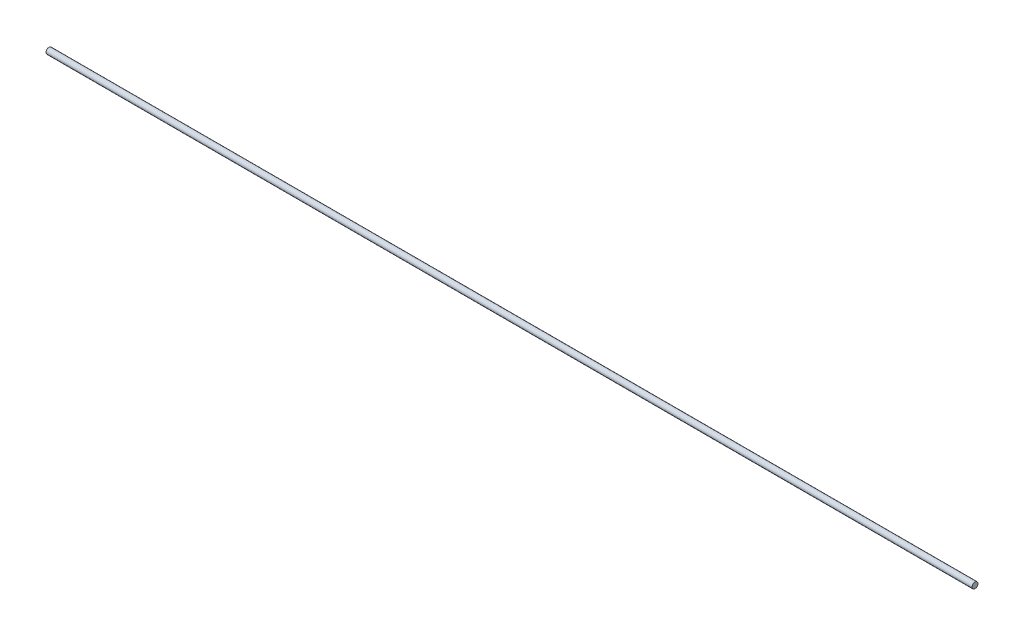
ISO-10303-21;
HEADER;
FILE_DESCRIPTION(('STEP AP214'),'2;1');
FILE_NAME('part.step','',(''),(''),'','','');
FILE_SCHEMA(('AUTOMOTIVE_DESIGN { 1 0 10303 214 1 1 1 1 }'));
ENDSEC;
DATA;
#1=APPLICATION_CONTEXT('core data for automotive mechanical design processes');
#2=APPLICATION_PROTOCOL_DEFINITION('international standard','automotive_design',2000,#1);
#3=PRODUCT_CONTEXT('',#1,'mechanical');
#4=PRODUCT('Part','Part','',(#3));
#5=PRODUCT_RELATED_PRODUCT_CATEGORY('part','',(#4));
#6=PRODUCT_DEFINITION_FORMATION('','',#4);
#7=PRODUCT_DEFINITION_CONTEXT('part definition',#1,'design');
#8=PRODUCT_DEFINITION('design','',#6,#7);
#9=PRODUCT_DEFINITION_SHAPE('','',#8);
#10=(LENGTH_UNIT() NAMED_UNIT(*) SI_UNIT(.MILLI.,.METRE.));
#11=(NAMED_UNIT(*) PLANE_ANGLE_UNIT() SI_UNIT($,.RADIAN.));
#12=(NAMED_UNIT(*) SI_UNIT($,.STERADIAN.) SOLID_ANGLE_UNIT());
#13=UNCERTAINTY_MEASURE_WITH_UNIT(LENGTH_MEASURE(1.E-05),#10,'distance_accuracy_value','');
#14=(GEOMETRIC_REPRESENTATION_CONTEXT(3) GLOBAL_UNCERTAINTY_ASSIGNED_CONTEXT((#13)) GLOBAL_UNIT_ASSIGNED_CONTEXT((#10,
#11,#12)) REPRESENTATION_CONTEXT('',''));
#15=CARTESIAN_POINT('',(0.,0.,0.));
#16=DIRECTION('',(0.,0.,1.));
#17=DIRECTION('',(1.,0.,0.));
#18=AXIS2_PLACEMENT_3D('',#15,#16,#17);
#19=CARTESIAN_POINT('',(495.3,0.,0.));
#20=DIRECTION('',(1.,0.,0.));
#21=DIRECTION('',(0.,0.,-1.));
#22=AXIS2_PLACEMENT_3D('',#19,#20,#21);
#23=PLANE('',#22);
#24=CARTESIAN_POINT('',(495.3,0.,0.));
#25=DIRECTION('',(1.,0.,0.));
#26=DIRECTION('',(0.,0.,-1.));
#27=AXIS2_PLACEMENT_3D('',#24,#25,#26);
#28=CIRCLE('',#27,3.175);
#29=CARTESIAN_POINT('',(495.3,0.,-3.175));
#30=VERTEX_POINT('',#29);
#31=EDGE_CURVE('E17',#30,#30,#28,.F.);
#32=ORIENTED_EDGE('',*,*,#31,.F.);
#33=EDGE_LOOP('',(#32));
#34=FACE_BOUND('',#33,.T.);
#35=ADVANCED_FACE('F14',(#34),#23,.T.);
#36=CARTESIAN_POINT('',(-495.3,0.,0.));
#37=DIRECTION('',(1.,0.,0.));
#38=DIRECTION('',(0.,0.,-1.));
#39=AXIS2_PLACEMENT_3D('',#36,#37,#38);
#40=PLANE('',#39);
#41=CARTESIAN_POINT('',(-495.3,0.,0.));
#42=DIRECTION('',(1.,0.,0.));
#43=DIRECTION('',(0.,0.,-1.));
#44=AXIS2_PLACEMENT_3D('',#41,#42,#43);
#45=CIRCLE('',#44,3.175);
#46=CARTESIAN_POINT('',(-495.3,0.,-3.175));
#47=VERTEX_POINT('',#46);
#48=EDGE_CURVE('E10',#47,#47,#45,.T.);
#49=ORIENTED_EDGE('',*,*,#48,.F.);
#50=EDGE_LOOP('',(#49));
#51=FACE_BOUND('',#50,.T.);
#52=ADVANCED_FACE('F29',(#51),#40,.F.);
#53=CARTESIAN_POINT('',(-495.3,0.,0.));
#54=DIRECTION('',(1.,0.,0.));
#55=DIRECTION('',(0.,0.,-1.));
#56=AXIS2_PLACEMENT_3D('',#53,#54,#55);
#57=CYLINDRICAL_SURFACE('',#56,3.175);
#58=ORIENTED_EDGE('',*,*,#31,.T.);
#59=EDGE_LOOP('',(#58));
#60=FACE_BOUND('',#59,.T.);
#61=ORIENTED_EDGE('',*,*,#48,.T.);
#62=EDGE_LOOP('',(#61));
#63=FACE_BOUND('',#62,.T.);
#64=ADVANCED_FACE('F26',(#60,#63),#57,.T.);
#65=CLOSED_SHELL('',(#35,#52,#64));
#66=MANIFOLD_SOLID_BREP('B1',#65);
#67=ADVANCED_BREP_SHAPE_REPRESENTATION('',(#18,#66),#14);
#68=SHAPE_DEFINITION_REPRESENTATION(#9,#67);
ENDSEC;
END-ISO-10303-21;
